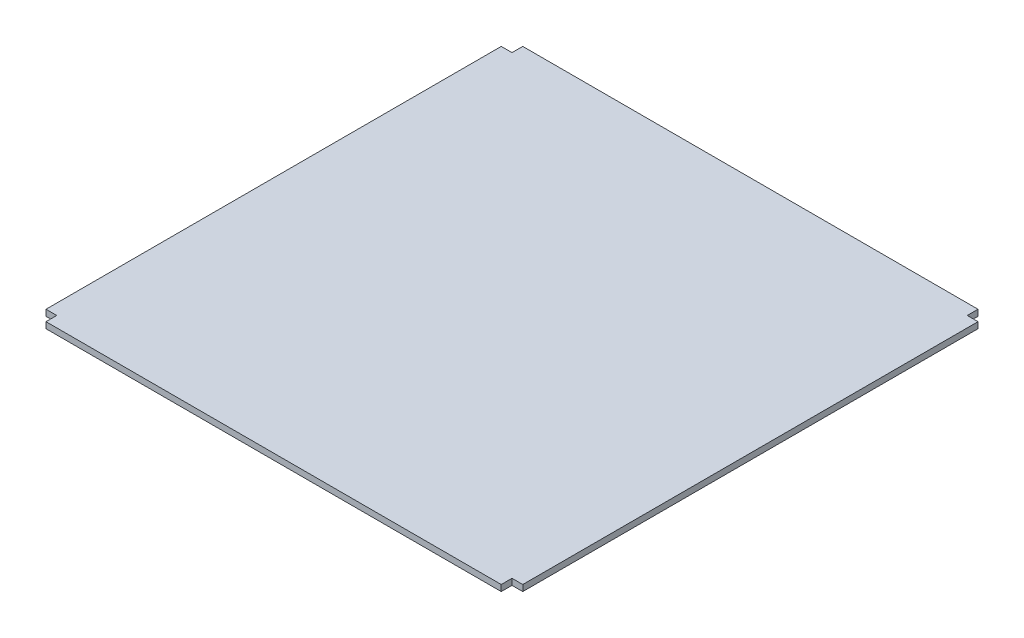
ISO-10303-21;
HEADER;
FILE_DESCRIPTION(('STEP AP214'),'2;1');
FILE_NAME('part.step','',(''),(''),'','','');
FILE_SCHEMA(('AUTOMOTIVE_DESIGN { 1 0 10303 214 1 1 1 1 }'));
ENDSEC;
DATA;
#1=APPLICATION_CONTEXT('core data for automotive mechanical design processes');
#2=APPLICATION_PROTOCOL_DEFINITION('international standard','automotive_design',2000,#1);
#3=PRODUCT_CONTEXT('',#1,'mechanical');
#4=PRODUCT('Part','Part','',(#3));
#5=PRODUCT_RELATED_PRODUCT_CATEGORY('part','',(#4));
#6=PRODUCT_DEFINITION_FORMATION('','',#4);
#7=PRODUCT_DEFINITION_CONTEXT('part definition',#1,'design');
#8=PRODUCT_DEFINITION('design','',#6,#7);
#9=PRODUCT_DEFINITION_SHAPE('','',#8);
#10=(LENGTH_UNIT() NAMED_UNIT(*) SI_UNIT(.MILLI.,.METRE.));
#11=(NAMED_UNIT(*) PLANE_ANGLE_UNIT() SI_UNIT($,.RADIAN.));
#12=(NAMED_UNIT(*) SI_UNIT($,.STERADIAN.) SOLID_ANGLE_UNIT());
#13=UNCERTAINTY_MEASURE_WITH_UNIT(LENGTH_MEASURE(1.E-05),#10,'distance_accuracy_value','');
#14=(GEOMETRIC_REPRESENTATION_CONTEXT(3) GLOBAL_UNCERTAINTY_ASSIGNED_CONTEXT((#13)) GLOBAL_UNIT_ASSIGNED_CONTEXT((#10,
#11,#12)) REPRESENTATION_CONTEXT('',''));
#15=CARTESIAN_POINT('',(0.,0.,0.));
#16=DIRECTION('',(0.,0.,1.));
#17=DIRECTION('',(1.,0.,0.));
#18=AXIS2_PLACEMENT_3D('',#15,#16,#17);
#19=CARTESIAN_POINT('',(155.,4.,155.));
#20=DIRECTION('',(-1.,0.,0.));
#21=DIRECTION('',(0.,0.,1.));
#22=AXIS2_PLACEMENT_3D('',#19,#20,#21);
#23=PLANE('',#22);
#24=DIRECTION('',(0.,0.,-1.));
#25=VECTOR('',#24,1.);
#26=CARTESIAN_POINT('',(155.,0.,155.));
#27=LINE('',#26,#25);
#28=CARTESIAN_POINT('',(155.,0.,148.));
#29=VERTEX_POINT('',#28);
#30=CARTESIAN_POINT('',(154.999999999999,0.,-148.000000000001));
#31=VERTEX_POINT('',#30);
#32=EDGE_CURVE('E165',#29,#31,#27,.T.);
#33=ORIENTED_EDGE('',*,*,#32,.T.);
#34=DIRECTION('',(0.,1.,0.));
#35=VECTOR('',#34,1.);
#36=CARTESIAN_POINT('',(154.999999999999,-2.,-148.000000000001));
#37=LINE('',#36,#35);
#38=CARTESIAN_POINT('',(154.999999999999,4.,-148.000000000001));
#39=VERTEX_POINT('',#38);
#40=EDGE_CURVE('E246',#31,#39,#37,.T.);
#41=ORIENTED_EDGE('',*,*,#40,.T.);
#42=DIRECTION('',(0.,0.,-1.));
#43=VECTOR('',#42,1.);
#44=CARTESIAN_POINT('',(155.,4.,155.));
#45=LINE('',#44,#43);
#46=CARTESIAN_POINT('',(155.,4.,148.));
#47=VERTEX_POINT('',#46);
#48=EDGE_CURVE('E151',#47,#39,#45,.T.);
#49=ORIENTED_EDGE('',*,*,#48,.F.);
#50=DIRECTION('',(0.,1.,0.));
#51=VECTOR('',#50,1.);
#52=CARTESIAN_POINT('',(155.,-2.,148.));
#53=LINE('',#52,#51);
#54=EDGE_CURVE('E250',#29,#47,#53,.T.);
#55=ORIENTED_EDGE('',*,*,#54,.F.);
#56=EDGE_LOOP('',(#33,#41,#49,#55));
#57=FACE_BOUND('',#56,.T.);
#58=ADVANCED_FACE('F39',(#57),#23,.F.);
#59=CARTESIAN_POINT('',(-155.,4.,-155.));
#60=DIRECTION('',(0.,0.,1.));
#61=DIRECTION('',(1.,0.,0.));
#62=AXIS2_PLACEMENT_3D('',#59,#60,#61);
#63=PLANE('',#62);
#64=DIRECTION('',(-1.,0.,0.));
#65=VECTOR('',#64,1.);
#66=CARTESIAN_POINT('',(-155.,4.,-155.));
#67=LINE('',#66,#65);
#68=CARTESIAN_POINT('',(147.999999999999,4.,-155.000000000001));
#69=VERTEX_POINT('',#68);
#70=CARTESIAN_POINT('',(-148.,4.,-155.));
#71=VERTEX_POINT('',#70);
#72=EDGE_CURVE('E143',#69,#71,#67,.T.);
#73=ORIENTED_EDGE('',*,*,#72,.F.);
#74=DIRECTION('',(0.,1.,0.));
#75=VECTOR('',#74,1.);
#76=CARTESIAN_POINT('',(147.999999999999,-2.,-155.000000000001));
#77=LINE('',#76,#75);
#78=CARTESIAN_POINT('',(147.999999999999,0.,-155.000000000001));
#79=VERTEX_POINT('',#78);
#80=EDGE_CURVE('E125',#79,#69,#77,.T.);
#81=ORIENTED_EDGE('',*,*,#80,.F.);
#82=DIRECTION('',(-1.,0.,0.));
#83=VECTOR('',#82,1.);
#84=CARTESIAN_POINT('',(-155.,0.,-155.));
#85=LINE('',#84,#83);
#86=CARTESIAN_POINT('',(-148.,0.,-155.));
#87=VERTEX_POINT('',#86);
#88=EDGE_CURVE('E169',#79,#87,#85,.T.);
#89=ORIENTED_EDGE('',*,*,#88,.T.);
#90=DIRECTION('',(0.,1.,0.));
#91=VECTOR('',#90,1.);
#92=CARTESIAN_POINT('',(-148.,-2.,-155.));
#93=LINE('',#92,#91);
#94=EDGE_CURVE('E145',#87,#71,#93,.T.);
#95=ORIENTED_EDGE('',*,*,#94,.T.);
#96=EDGE_LOOP('',(#73,#81,#89,#95));
#97=FACE_BOUND('',#96,.T.);
#98=ADVANCED_FACE('F148',(#97),#63,.F.);
#99=CARTESIAN_POINT('',(-155.,4.,155.));
#100=DIRECTION('',(1.,0.,0.));
#101=DIRECTION('',(0.,0.,-1.));
#102=AXIS2_PLACEMENT_3D('',#99,#100,#101);
#103=PLANE('',#102);
#104=DIRECTION('',(0.,0.,1.));
#105=VECTOR('',#104,1.);
#106=CARTESIAN_POINT('',(-155.,4.,155.));
#107=LINE('',#106,#105);
#108=CARTESIAN_POINT('',(-155.,4.,-148.));
#109=VERTEX_POINT('',#108);
#110=CARTESIAN_POINT('',(-154.999999999998,4.,148.000000000002));
#111=VERTEX_POINT('',#110);
#112=EDGE_CURVE('E150',#109,#111,#107,.T.);
#113=ORIENTED_EDGE('',*,*,#112,.F.);
#114=DIRECTION('',(0.,1.,0.));
#115=VECTOR('',#114,1.);
#116=CARTESIAN_POINT('',(-155.,-2.,-148.));
#117=LINE('',#116,#115);
#118=CARTESIAN_POINT('',(-155.,0.,-148.));
#119=VERTEX_POINT('',#118);
#120=EDGE_CURVE('E209',#119,#109,#117,.T.);
#121=ORIENTED_EDGE('',*,*,#120,.F.);
#122=DIRECTION('',(0.,0.,1.));
#123=VECTOR('',#122,1.);
#124=CARTESIAN_POINT('',(-155.,0.,155.));
#125=LINE('',#124,#123);
#126=CARTESIAN_POINT('',(-154.999999999998,0.,148.000000000002));
#127=VERTEX_POINT('',#126);
#128=EDGE_CURVE('E173',#119,#127,#125,.T.);
#129=ORIENTED_EDGE('',*,*,#128,.T.);
#130=DIRECTION('',(0.,1.,0.));
#131=VECTOR('',#130,1.);
#132=CARTESIAN_POINT('',(-154.999999999998,-2.,148.000000000002));
#133=LINE('',#132,#131);
#134=EDGE_CURVE('E233',#127,#111,#133,.T.);
#135=ORIENTED_EDGE('',*,*,#134,.T.);
#136=EDGE_LOOP('',(#113,#121,#129,#135));
#137=FACE_BOUND('',#136,.T.);
#138=ADVANCED_FACE('F213',(#137),#103,.F.);
#139=CARTESIAN_POINT('',(-155.,4.,155.));
#140=DIRECTION('',(0.,0.,-1.));
#141=DIRECTION('',(-1.,0.,0.));
#142=AXIS2_PLACEMENT_3D('',#139,#140,#141);
#143=PLANE('',#142);
#144=DIRECTION('',(1.,0.,0.));
#145=VECTOR('',#144,1.);
#146=CARTESIAN_POINT('',(-155.,4.,155.));
#147=LINE('',#146,#145);
#148=CARTESIAN_POINT('',(-147.999999999998,4.,155.000000000002));
#149=VERTEX_POINT('',#148);
#150=CARTESIAN_POINT('',(148.,4.,155.));
#151=VERTEX_POINT('',#150);
#152=EDGE_CURVE('E156',#149,#151,#147,.T.);
#153=ORIENTED_EDGE('',*,*,#152,.F.);
#154=DIRECTION('',(0.,1.,0.));
#155=VECTOR('',#154,1.);
#156=CARTESIAN_POINT('',(-147.999999999998,-2.,155.000000000002));
#157=LINE('',#156,#155);
#158=CARTESIAN_POINT('',(-147.999999999998,0.,155.000000000002));
#159=VERTEX_POINT('',#158);
#160=EDGE_CURVE('E232',#159,#149,#157,.T.);
#161=ORIENTED_EDGE('',*,*,#160,.F.);
#162=DIRECTION('',(1.,0.,0.));
#163=VECTOR('',#162,1.);
#164=CARTESIAN_POINT('',(-155.,0.,155.));
#165=LINE('',#164,#163);
#166=CARTESIAN_POINT('',(148.,0.,155.));
#167=VERTEX_POINT('',#166);
#168=EDGE_CURVE('E158',#159,#167,#165,.T.);
#169=ORIENTED_EDGE('',*,*,#168,.T.);
#170=DIRECTION('',(0.,1.,0.));
#171=VECTOR('',#170,1.);
#172=CARTESIAN_POINT('',(148.,-2.,155.));
#173=LINE('',#172,#171);
#174=EDGE_CURVE('E170',#167,#151,#173,.T.);
#175=ORIENTED_EDGE('',*,*,#174,.T.);
#176=EDGE_LOOP('',(#153,#161,#169,#175));
#177=FACE_BOUND('',#176,.T.);
#178=ADVANCED_FACE('F286',(#177),#143,.F.);
#179=CARTESIAN_POINT('',(0.,4.,0.));
#180=DIRECTION('',(0.,-1.,0.));
#181=DIRECTION('',(0.,0.,-1.));
#182=AXIS2_PLACEMENT_3D('',#179,#180,#181);
#183=PLANE('',#182);
#184=ORIENTED_EDGE('',*,*,#48,.T.);
#185=DIRECTION('',(1.,0.,0.));
#186=VECTOR('',#185,1.);
#187=CARTESIAN_POINT('',(154.999999999999,4.,-148.000000000001));
#188=LINE('',#187,#186);
#189=CARTESIAN_POINT('',(147.999999999999,4.,-148.000000000001));
#190=VERTEX_POINT('',#189);
#191=EDGE_CURVE('E136',#190,#39,#188,.T.);
#192=ORIENTED_EDGE('',*,*,#191,.F.);
#193=DIRECTION('',(0.,0.,1.));
#194=VECTOR('',#193,1.);
#195=CARTESIAN_POINT('',(147.999999999999,4.,-155.000000000001));
#196=LINE('',#195,#194);
#197=EDGE_CURVE('E128',#69,#190,#196,.T.);
#198=ORIENTED_EDGE('',*,*,#197,.F.);
#199=ORIENTED_EDGE('',*,*,#72,.T.);
#200=DIRECTION('',(0.,0.,-1.));
#201=VECTOR('',#200,1.);
#202=CARTESIAN_POINT('',(-148.,4.,-155.));
#203=LINE('',#202,#201);
#204=CARTESIAN_POINT('',(-148.,4.,-148.));
#205=VERTEX_POINT('',#204);
#206=EDGE_CURVE('E216',#205,#71,#203,.T.);
#207=ORIENTED_EDGE('',*,*,#206,.F.);
#208=DIRECTION('',(1.,0.,0.));
#209=VECTOR('',#208,1.);
#210=CARTESIAN_POINT('',(-155.,4.,-148.));
#211=LINE('',#210,#209);
#212=EDGE_CURVE('E221',#109,#205,#211,.T.);
#213=ORIENTED_EDGE('',*,*,#212,.F.);
#214=ORIENTED_EDGE('',*,*,#112,.T.);
#215=DIRECTION('',(-1.,0.,0.));
#216=VECTOR('',#215,1.);
#217=CARTESIAN_POINT('',(-154.999999999998,4.,148.000000000002));
#218=LINE('',#217,#216);
#219=CARTESIAN_POINT('',(-147.999999999998,4.,148.000000000002));
#220=VERTEX_POINT('',#219);
#221=EDGE_CURVE('E229',#220,#111,#218,.T.);
#222=ORIENTED_EDGE('',*,*,#221,.F.);
#223=DIRECTION('',(0.,0.,-1.));
#224=VECTOR('',#223,1.);
#225=CARTESIAN_POINT('',(-147.999999999998,4.,155.000000000002));
#226=LINE('',#225,#224);
#227=EDGE_CURVE('E225',#149,#220,#226,.T.);
#228=ORIENTED_EDGE('',*,*,#227,.F.);
#229=ORIENTED_EDGE('',*,*,#152,.T.);
#230=DIRECTION('',(0.,0.,1.));
#231=VECTOR('',#230,1.);
#232=CARTESIAN_POINT('',(148.,4.,155.));
#233=LINE('',#232,#231);
#234=CARTESIAN_POINT('',(148.,4.,148.));
#235=VERTEX_POINT('',#234);
#236=EDGE_CURVE('E245',#235,#151,#233,.T.);
#237=ORIENTED_EDGE('',*,*,#236,.F.);
#238=DIRECTION('',(-1.,0.,0.));
#239=VECTOR('',#238,1.);
#240=CARTESIAN_POINT('',(155.,4.,148.));
#241=LINE('',#240,#239);
#242=EDGE_CURVE('E241',#47,#235,#241,.T.);
#243=ORIENTED_EDGE('',*,*,#242,.F.);
#244=EDGE_LOOP('',(#184,#192,#198,#199,#207,#213,#214,#222,#228,#229,#237,#243));
#245=FACE_BOUND('',#244,.T.);
#246=ADVANCED_FACE('F141',(#245),#183,.F.);
#247=CARTESIAN_POINT('',(0.,0.,0.));
#248=DIRECTION('',(0.,-1.,0.));
#249=DIRECTION('',(0.,0.,-1.));
#250=AXIS2_PLACEMENT_3D('',#247,#248,#249);
#251=PLANE('',#250);
#252=DIRECTION('',(-1.,0.,0.));
#253=VECTOR('',#252,1.);
#254=CARTESIAN_POINT('',(-5.16739238148784E-13,0.,-148.));
#255=LINE('',#254,#253);
#256=CARTESIAN_POINT('',(147.999999999999,0.,-148.000000000001));
#257=VERTEX_POINT('',#256);
#258=EDGE_CURVE('E11',#31,#257,#255,.T.);
#259=ORIENTED_EDGE('',*,*,#258,.F.);
#260=ORIENTED_EDGE('',*,*,#32,.F.);
#261=DIRECTION('',(1.,0.,0.));
#262=VECTOR('',#261,1.);
#263=CARTESIAN_POINT('',(0.,0.,148.));
#264=LINE('',#263,#262);
#265=CARTESIAN_POINT('',(148.,0.,148.));
#266=VERTEX_POINT('',#265);
#267=EDGE_CURVE('E164',#266,#29,#264,.T.);
#268=ORIENTED_EDGE('',*,*,#267,.F.);
#269=DIRECTION('',(0.,0.,-1.));
#270=VECTOR('',#269,1.);
#271=CARTESIAN_POINT('',(148.,0.,0.));
#272=LINE('',#271,#270);
#273=EDGE_CURVE('E181',#167,#266,#272,.T.);
#274=ORIENTED_EDGE('',*,*,#273,.F.);
#275=ORIENTED_EDGE('',*,*,#168,.F.);
#276=DIRECTION('',(0.,0.,1.));
#277=VECTOR('',#276,1.);
#278=CARTESIAN_POINT('',(-148.,0.,1.55021771444635E-12));
#279=LINE('',#278,#277);
#280=CARTESIAN_POINT('',(-147.999999999998,0.,148.000000000002));
#281=VERTEX_POINT('',#280);
#282=EDGE_CURVE('E185',#281,#159,#279,.T.);
#283=ORIENTED_EDGE('',*,*,#282,.F.);
#284=DIRECTION('',(1.,0.,0.));
#285=VECTOR('',#284,1.);
#286=CARTESIAN_POINT('',(1.55021771444635E-12,0.,148.));
#287=LINE('',#286,#285);
#288=EDGE_CURVE('E188',#127,#281,#287,.T.);
#289=ORIENTED_EDGE('',*,*,#288,.F.);
#290=ORIENTED_EDGE('',*,*,#128,.F.);
#291=DIRECTION('',(-1.,0.,0.));
#292=VECTOR('',#291,1.);
#293=CARTESIAN_POINT('',(0.,0.,-148.));
#294=LINE('',#293,#292);
#295=CARTESIAN_POINT('',(-148.,0.,-148.));
#296=VERTEX_POINT('',#295);
#297=EDGE_CURVE('E192',#296,#119,#294,.T.);
#298=ORIENTED_EDGE('',*,*,#297,.F.);
#299=DIRECTION('',(0.,0.,1.));
#300=VECTOR('',#299,1.);
#301=CARTESIAN_POINT('',(-148.,0.,0.));
#302=LINE('',#301,#300);
#303=EDGE_CURVE('E195',#87,#296,#302,.T.);
#304=ORIENTED_EDGE('',*,*,#303,.F.);
#305=ORIENTED_EDGE('',*,*,#88,.F.);
#306=DIRECTION('',(0.,0.,-1.));
#307=VECTOR('',#306,1.);
#308=CARTESIAN_POINT('',(148.,0.,-5.16739238148784E-13));
#309=LINE('',#308,#307);
#310=EDGE_CURVE('E47',#257,#79,#309,.T.);
#311=ORIENTED_EDGE('',*,*,#310,.F.);
#312=EDGE_LOOP('',(#259,#260,#268,#274,#275,#283,#289,#290,#298,#304,#305,#311));
#313=FACE_BOUND('',#312,.T.);
#314=ADVANCED_FACE('F205',(#313),#251,.T.);
#315=CARTESIAN_POINT('',(148.,-2.,155.));
#316=DIRECTION('',(-1.,0.,0.));
#317=DIRECTION('',(0.,0.,1.));
#318=AXIS2_PLACEMENT_3D('',#315,#316,#317);
#319=PLANE('',#318);
#320=ORIENTED_EDGE('',*,*,#273,.T.);
#321=DIRECTION('',(0.,1.,0.));
#322=VECTOR('',#321,1.);
#323=CARTESIAN_POINT('',(148.,-2.,148.));
#324=LINE('',#323,#322);
#325=EDGE_CURVE('E254',#266,#235,#324,.T.);
#326=ORIENTED_EDGE('',*,*,#325,.T.);
#327=ORIENTED_EDGE('',*,*,#236,.T.);
#328=ORIENTED_EDGE('',*,*,#174,.F.);
#329=EDGE_LOOP('',(#320,#326,#327,#328));
#330=FACE_BOUND('',#329,.T.);
#331=ADVANCED_FACE('F283',(#330),#319,.F.);
#332=CARTESIAN_POINT('',(155.,-2.,148.));
#333=DIRECTION('',(0.,0.,-1.));
#334=DIRECTION('',(-1.,0.,0.));
#335=AXIS2_PLACEMENT_3D('',#332,#333,#334);
#336=PLANE('',#335);
#337=ORIENTED_EDGE('',*,*,#267,.T.);
#338=ORIENTED_EDGE('',*,*,#54,.T.);
#339=ORIENTED_EDGE('',*,*,#242,.T.);
#340=ORIENTED_EDGE('',*,*,#325,.F.);
#341=EDGE_LOOP('',(#337,#338,#339,#340));
#342=FACE_BOUND('',#341,.T.);
#343=ADVANCED_FACE('F260',(#342),#336,.F.);
#344=CARTESIAN_POINT('',(-154.999999999998,-2.,148.000000000002));
#345=DIRECTION('',(0.,0.,-1.));
#346=DIRECTION('',(-1.,0.,0.));
#347=AXIS2_PLACEMENT_3D('',#344,#345,#346);
#348=PLANE('',#347);
#349=ORIENTED_EDGE('',*,*,#288,.T.);
#350=DIRECTION('',(0.,1.,0.));
#351=VECTOR('',#350,1.);
#352=CARTESIAN_POINT('',(-147.999999999998,-2.,148.000000000002));
#353=LINE('',#352,#351);
#354=EDGE_CURVE('E236',#281,#220,#353,.T.);
#355=ORIENTED_EDGE('',*,*,#354,.T.);
#356=ORIENTED_EDGE('',*,*,#221,.T.);
#357=ORIENTED_EDGE('',*,*,#134,.F.);
#358=EDGE_LOOP('',(#349,#355,#356,#357));
#359=FACE_BOUND('',#358,.T.);
#360=ADVANCED_FACE('F293',(#359),#348,.F.);
#361=CARTESIAN_POINT('',(-147.999999999998,-2.,155.000000000002));
#362=DIRECTION('',(1.,0.,0.));
#363=DIRECTION('',(0.,0.,-1.));
#364=AXIS2_PLACEMENT_3D('',#361,#362,#363);
#365=PLANE('',#364);
#366=ORIENTED_EDGE('',*,*,#282,.T.);
#367=ORIENTED_EDGE('',*,*,#160,.T.);
#368=ORIENTED_EDGE('',*,*,#227,.T.);
#369=ORIENTED_EDGE('',*,*,#354,.F.);
#370=EDGE_LOOP('',(#366,#367,#368,#369));
#371=FACE_BOUND('',#370,.T.);
#372=ADVANCED_FACE('F290',(#371),#365,.F.);
#373=CARTESIAN_POINT('',(-148.,-2.,-155.));
#374=DIRECTION('',(1.,0.,0.));
#375=DIRECTION('',(0.,0.,-1.));
#376=AXIS2_PLACEMENT_3D('',#373,#374,#375);
#377=PLANE('',#376);
#378=ORIENTED_EDGE('',*,*,#303,.T.);
#379=DIRECTION('',(0.,1.,0.));
#380=VECTOR('',#379,1.);
#381=CARTESIAN_POINT('',(-148.,-2.,-148.));
#382=LINE('',#381,#380);
#383=EDGE_CURVE('E61',#296,#205,#382,.T.);
#384=ORIENTED_EDGE('',*,*,#383,.T.);
#385=ORIENTED_EDGE('',*,*,#206,.T.);
#386=ORIENTED_EDGE('',*,*,#94,.F.);
#387=EDGE_LOOP('',(#378,#384,#385,#386));
#388=FACE_BOUND('',#387,.T.);
#389=ADVANCED_FACE('F201',(#388),#377,.F.);
#390=CARTESIAN_POINT('',(-155.,-2.,-148.));
#391=DIRECTION('',(0.,0.,1.));
#392=DIRECTION('',(1.,0.,0.));
#393=AXIS2_PLACEMENT_3D('',#390,#391,#392);
#394=PLANE('',#393);
#395=ORIENTED_EDGE('',*,*,#297,.T.);
#396=ORIENTED_EDGE('',*,*,#120,.T.);
#397=ORIENTED_EDGE('',*,*,#212,.T.);
#398=ORIENTED_EDGE('',*,*,#383,.F.);
#399=EDGE_LOOP('',(#395,#396,#397,#398));
#400=FACE_BOUND('',#399,.T.);
#401=ADVANCED_FACE('F208',(#400),#394,.F.);
#402=CARTESIAN_POINT('',(154.999999999999,-2.,-148.000000000001));
#403=DIRECTION('',(0.,0.,1.));
#404=DIRECTION('',(1.,0.,0.));
#405=AXIS2_PLACEMENT_3D('',#402,#403,#404);
#406=PLANE('',#405);
#407=ORIENTED_EDGE('',*,*,#258,.T.);
#408=DIRECTION('',(0.,1.,0.));
#409=VECTOR('',#408,1.);
#410=CARTESIAN_POINT('',(147.999999999999,-2.,-148.000000000001));
#411=LINE('',#410,#409);
#412=EDGE_CURVE('E54',#257,#190,#411,.T.);
#413=ORIENTED_EDGE('',*,*,#412,.T.);
#414=ORIENTED_EDGE('',*,*,#191,.T.);
#415=ORIENTED_EDGE('',*,*,#40,.F.);
#416=EDGE_LOOP('',(#407,#413,#414,#415));
#417=FACE_BOUND('',#416,.T.);
#418=ADVANCED_FACE('F277',(#417),#406,.F.);
#419=CARTESIAN_POINT('',(147.999999999999,-2.,-155.000000000001));
#420=DIRECTION('',(-1.,0.,0.));
#421=DIRECTION('',(0.,0.,1.));
#422=AXIS2_PLACEMENT_3D('',#419,#420,#421);
#423=PLANE('',#422);
#424=ORIENTED_EDGE('',*,*,#310,.T.);
#425=ORIENTED_EDGE('',*,*,#80,.T.);
#426=ORIENTED_EDGE('',*,*,#197,.T.);
#427=ORIENTED_EDGE('',*,*,#412,.F.);
#428=EDGE_LOOP('',(#424,#425,#426,#427));
#429=FACE_BOUND('',#428,.T.);
#430=ADVANCED_FACE('F127',(#429),#423,.F.);
#431=CLOSED_SHELL('',(#58,#98,#138,#178,#246,#314,#331,#343,#360,#372,#389,#401,#418,#430));
#432=MANIFOLD_SOLID_BREP('B2',#431);
#433=ADVANCED_BREP_SHAPE_REPRESENTATION('',(#18,#432),#14);
#434=SHAPE_DEFINITION_REPRESENTATION(#9,#433);
ENDSEC;
END-ISO-10303-21;
